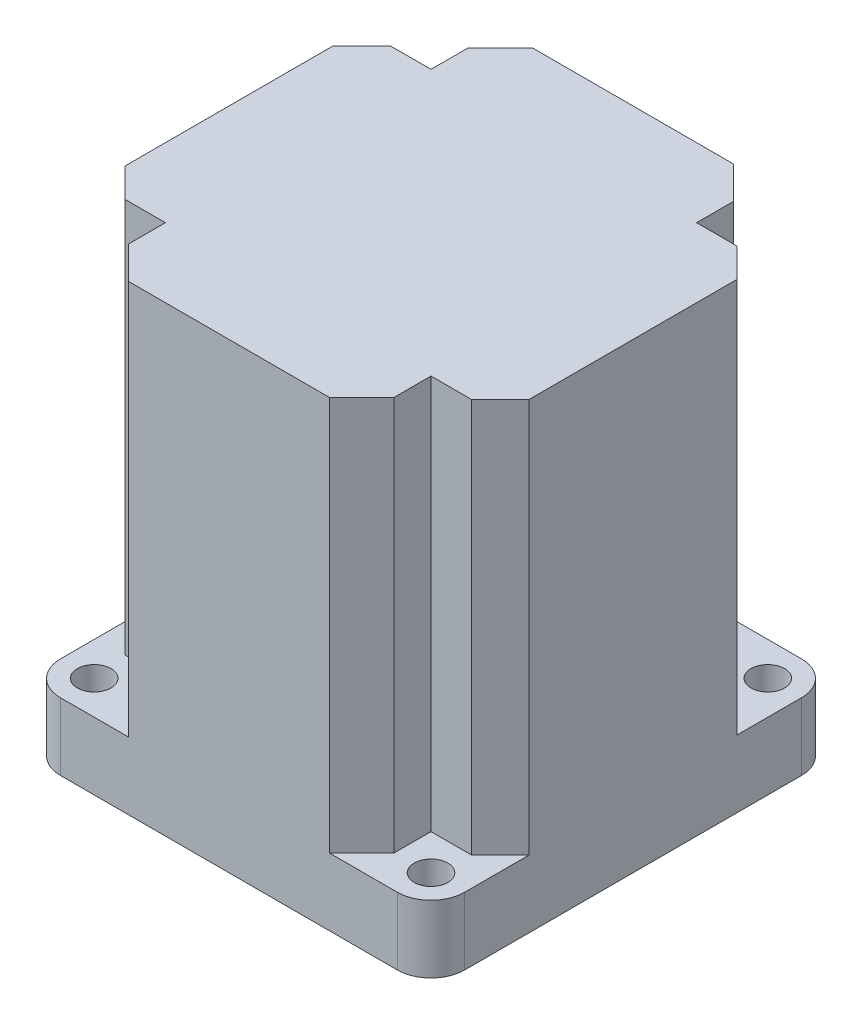
ISO-10303-21;
HEADER;
FILE_DESCRIPTION(('STEP AP214'),'2;1');
FILE_NAME('part.step','',(''),(''),'','','');
FILE_SCHEMA(('AUTOMOTIVE_DESIGN { 1 0 10303 214 1 1 1 1 }'));
ENDSEC;
DATA;
#1=APPLICATION_CONTEXT('core data for automotive mechanical design processes');
#2=APPLICATION_PROTOCOL_DEFINITION('international standard','automotive_design',2000,#1);
#3=PRODUCT_CONTEXT('',#1,'mechanical');
#4=PRODUCT('Part','Part','',(#3));
#5=PRODUCT_RELATED_PRODUCT_CATEGORY('part','',(#4));
#6=PRODUCT_DEFINITION_FORMATION('','',#4);
#7=PRODUCT_DEFINITION_CONTEXT('part definition',#1,'design');
#8=PRODUCT_DEFINITION('design','',#6,#7);
#9=PRODUCT_DEFINITION_SHAPE('','',#8);
#10=(LENGTH_UNIT() NAMED_UNIT(*) SI_UNIT(.MILLI.,.METRE.));
#11=(NAMED_UNIT(*) PLANE_ANGLE_UNIT() SI_UNIT($,.RADIAN.));
#12=(NAMED_UNIT(*) SI_UNIT($,.STERADIAN.) SOLID_ANGLE_UNIT());
#13=UNCERTAINTY_MEASURE_WITH_UNIT(LENGTH_MEASURE(1.E-05),#10,'distance_accuracy_value','');
#14=(GEOMETRIC_REPRESENTATION_CONTEXT(3) GLOBAL_UNCERTAINTY_ASSIGNED_CONTEXT((#13)) GLOBAL_UNIT_ASSIGNED_CONTEXT((#10,
#11,#12)) REPRESENTATION_CONTEXT('',''));
#15=CARTESIAN_POINT('',(0.,0.,0.));
#16=DIRECTION('',(0.,0.,1.));
#17=DIRECTION('',(1.,0.,0.));
#18=AXIS2_PLACEMENT_3D('',#15,#16,#17);
#19=CARTESIAN_POINT('',(17.5,7.,-17.5));
#20=DIRECTION('',(0.,-1.,0.));
#21=DIRECTION('',(0.,0.,-1.));
#22=AXIS2_PLACEMENT_3D('',#19,#20,#21);
#23=CYLINDRICAL_SURFACE('',#22,3.5);
#24=CARTESIAN_POINT('',(17.5,7.,-17.5));
#25=DIRECTION('',(0.,1.,0.));
#26=DIRECTION('',(0.,0.,1.));
#27=AXIS2_PLACEMENT_3D('',#24,#25,#26);
#28=CIRCLE('',#27,3.5);
#29=CARTESIAN_POINT('',(21.,7.,-17.5));
#30=VERTEX_POINT('',#29);
#31=CARTESIAN_POINT('',(17.5,7.,-21.));
#32=VERTEX_POINT('',#31);
#33=EDGE_CURVE('E437',#30,#32,#28,.T.);
#34=ORIENTED_EDGE('',*,*,#33,.F.);
#35=DIRECTION('',(0.,-1.,0.));
#36=VECTOR('',#35,1.);
#37=CARTESIAN_POINT('',(21.,7.,-17.5));
#38=LINE('',#37,#36);
#39=CARTESIAN_POINT('',(21.,0.,-17.5));
#40=VERTEX_POINT('',#39);
#41=EDGE_CURVE('E249',#30,#40,#38,.T.);
#42=ORIENTED_EDGE('',*,*,#41,.T.);
#43=CARTESIAN_POINT('',(17.5,0.,-17.5));
#44=DIRECTION('',(0.,1.,0.));
#45=DIRECTION('',(0.,0.,1.));
#46=AXIS2_PLACEMENT_3D('',#43,#44,#45);
#47=CIRCLE('',#46,3.5);
#48=CARTESIAN_POINT('',(17.5,0.,-21.));
#49=VERTEX_POINT('',#48);
#50=EDGE_CURVE('E283',#40,#49,#47,.T.);
#51=ORIENTED_EDGE('',*,*,#50,.T.);
#52=DIRECTION('',(0.,-1.,0.));
#53=VECTOR('',#52,1.);
#54=CARTESIAN_POINT('',(17.5,7.,-21.));
#55=LINE('',#54,#53);
#56=EDGE_CURVE('E11',#32,#49,#55,.T.);
#57=ORIENTED_EDGE('',*,*,#56,.F.);
#58=EDGE_LOOP('',(#34,#42,#51,#57));
#59=FACE_BOUND('',#58,.T.);
#60=ADVANCED_FACE('F38',(#59),#23,.T.);
#61=CARTESIAN_POINT('',(-17.5,7.,-17.5));
#62=DIRECTION('',(0.,-1.,0.));
#63=DIRECTION('',(0.,0.,-1.));
#64=AXIS2_PLACEMENT_3D('',#61,#62,#63);
#65=CYLINDRICAL_SURFACE('',#64,3.5);
#66=CARTESIAN_POINT('',(-17.5,7.,-17.5));
#67=DIRECTION('',(0.,1.,0.));
#68=DIRECTION('',(0.,0.,1.));
#69=AXIS2_PLACEMENT_3D('',#66,#67,#68);
#70=CIRCLE('',#69,3.5);
#71=CARTESIAN_POINT('',(-17.5,7.,-21.));
#72=VERTEX_POINT('',#71);
#73=CARTESIAN_POINT('',(-21.,7.,-17.5));
#74=VERTEX_POINT('',#73);
#75=EDGE_CURVE('E271',#72,#74,#70,.T.);
#76=ORIENTED_EDGE('',*,*,#75,.F.);
#77=DIRECTION('',(0.,-1.,0.));
#78=VECTOR('',#77,1.);
#79=CARTESIAN_POINT('',(-17.5,7.,-21.));
#80=LINE('',#79,#78);
#81=CARTESIAN_POINT('',(-17.5,0.,-21.));
#82=VERTEX_POINT('',#81);
#83=EDGE_CURVE('E45',#72,#82,#80,.T.);
#84=ORIENTED_EDGE('',*,*,#83,.T.);
#85=CARTESIAN_POINT('',(-17.5,0.,-17.5));
#86=DIRECTION('',(0.,1.,0.));
#87=DIRECTION('',(0.,0.,-1.));
#88=AXIS2_PLACEMENT_3D('',#85,#86,#87);
#89=CIRCLE('',#88,3.5);
#90=CARTESIAN_POINT('',(-21.,0.,-17.5));
#91=VERTEX_POINT('',#90);
#92=EDGE_CURVE('E269',#82,#91,#89,.T.);
#93=ORIENTED_EDGE('',*,*,#92,.T.);
#94=DIRECTION('',(0.,-1.,0.));
#95=VECTOR('',#94,1.);
#96=CARTESIAN_POINT('',(-21.,7.,-17.5));
#97=LINE('',#96,#95);
#98=EDGE_CURVE('E260',#74,#91,#97,.T.);
#99=ORIENTED_EDGE('',*,*,#98,.F.);
#100=EDGE_LOOP('',(#76,#84,#93,#99));
#101=FACE_BOUND('',#100,.T.);
#102=ADVANCED_FACE('F266',(#101),#65,.T.);
#103=CARTESIAN_POINT('',(-17.5,7.,17.5));
#104=DIRECTION('',(0.,-1.,0.));
#105=DIRECTION('',(0.,0.,-1.));
#106=AXIS2_PLACEMENT_3D('',#103,#104,#105);
#107=CYLINDRICAL_SURFACE('',#106,3.49999999999999);
#108=CARTESIAN_POINT('',(-17.5,7.,17.5));
#109=DIRECTION('',(0.,1.,0.));
#110=DIRECTION('',(0.,0.,1.));
#111=AXIS2_PLACEMENT_3D('',#108,#109,#110);
#112=CIRCLE('',#111,3.49999999999999);
#113=CARTESIAN_POINT('',(-21.,7.,17.5));
#114=VERTEX_POINT('',#113);
#115=CARTESIAN_POINT('',(-17.5,7.,21.));
#116=VERTEX_POINT('',#115);
#117=EDGE_CURVE('E396',#114,#116,#112,.T.);
#118=ORIENTED_EDGE('',*,*,#117,.F.);
#119=DIRECTION('',(0.,-1.,0.));
#120=VECTOR('',#119,1.);
#121=CARTESIAN_POINT('',(-21.,7.,17.5));
#122=LINE('',#121,#120);
#123=CARTESIAN_POINT('',(-21.,0.,17.5));
#124=VERTEX_POINT('',#123);
#125=EDGE_CURVE('E258',#114,#124,#122,.T.);
#126=ORIENTED_EDGE('',*,*,#125,.T.);
#127=CARTESIAN_POINT('',(-17.5,0.,17.5));
#128=DIRECTION('',(0.,1.,0.));
#129=DIRECTION('',(0.,0.,-1.));
#130=AXIS2_PLACEMENT_3D('',#127,#128,#129);
#131=CIRCLE('',#130,3.49999999999999);
#132=CARTESIAN_POINT('',(-17.5,0.,21.));
#133=VERTEX_POINT('',#132);
#134=EDGE_CURVE('E291',#124,#133,#131,.T.);
#135=ORIENTED_EDGE('',*,*,#134,.T.);
#136=DIRECTION('',(0.,-1.,0.));
#137=VECTOR('',#136,1.);
#138=CARTESIAN_POINT('',(-17.5,7.,21.));
#139=LINE('',#138,#137);
#140=EDGE_CURVE('E251',#116,#133,#139,.T.);
#141=ORIENTED_EDGE('',*,*,#140,.F.);
#142=EDGE_LOOP('',(#118,#126,#135,#141));
#143=FACE_BOUND('',#142,.T.);
#144=ADVANCED_FACE('F512',(#143),#107,.T.);
#145=CARTESIAN_POINT('',(17.5,7.,17.5));
#146=DIRECTION('',(0.,-1.,0.));
#147=DIRECTION('',(0.,0.,-1.));
#148=AXIS2_PLACEMENT_3D('',#145,#146,#147);
#149=CYLINDRICAL_SURFACE('',#148,3.5);
#150=CARTESIAN_POINT('',(17.5,7.,17.5));
#151=DIRECTION('',(0.,1.,0.));
#152=DIRECTION('',(0.,0.,1.));
#153=AXIS2_PLACEMENT_3D('',#150,#151,#152);
#154=CIRCLE('',#153,3.5);
#155=CARTESIAN_POINT('',(17.5,7.,21.));
#156=VERTEX_POINT('',#155);
#157=CARTESIAN_POINT('',(21.,7.,17.5));
#158=VERTEX_POINT('',#157);
#159=EDGE_CURVE('E222',#156,#158,#154,.T.);
#160=ORIENTED_EDGE('',*,*,#159,.F.);
#161=DIRECTION('',(0.,-1.,0.));
#162=VECTOR('',#161,1.);
#163=CARTESIAN_POINT('',(17.5,7.,21.));
#164=LINE('',#163,#162);
#165=CARTESIAN_POINT('',(17.5,0.,21.));
#166=VERTEX_POINT('',#165);
#167=EDGE_CURVE('E248',#156,#166,#164,.T.);
#168=ORIENTED_EDGE('',*,*,#167,.T.);
#169=CARTESIAN_POINT('',(17.5,0.,17.5));
#170=DIRECTION('',(0.,1.,0.));
#171=DIRECTION('',(0.,0.,-1.));
#172=AXIS2_PLACEMENT_3D('',#169,#170,#171);
#173=CIRCLE('',#172,3.5);
#174=CARTESIAN_POINT('',(21.,0.,17.5));
#175=VERTEX_POINT('',#174);
#176=EDGE_CURVE('E246',#166,#175,#173,.T.);
#177=ORIENTED_EDGE('',*,*,#176,.T.);
#178=DIRECTION('',(0.,-1.,0.));
#179=VECTOR('',#178,1.);
#180=CARTESIAN_POINT('',(21.,7.,17.5));
#181=LINE('',#180,#179);
#182=EDGE_CURVE('E239',#158,#175,#181,.T.);
#183=ORIENTED_EDGE('',*,*,#182,.F.);
#184=EDGE_LOOP('',(#160,#168,#177,#183));
#185=FACE_BOUND('',#184,.T.);
#186=ADVANCED_FACE('F244',(#185),#149,.T.);
#187=CARTESIAN_POINT('',(17.5,0.,-17.5));
#188=DIRECTION('',(0.,1.,0.));
#189=DIRECTION('',(0.,0.,1.));
#190=AXIS2_PLACEMENT_3D('',#187,#188,#189);
#191=PLANE('',#190);
#192=ORIENTED_EDGE('',*,*,#50,.F.);
#193=DIRECTION('',(0.,0.,-1.));
#194=VECTOR('',#193,1.);
#195=CARTESIAN_POINT('',(21.,0.,17.5));
#196=LINE('',#195,#194);
#197=EDGE_CURVE('E253',#175,#40,#196,.T.);
#198=ORIENTED_EDGE('',*,*,#197,.F.);
#199=ORIENTED_EDGE('',*,*,#176,.F.);
#200=DIRECTION('',(1.,0.,0.));
#201=VECTOR('',#200,1.);
#202=CARTESIAN_POINT('',(17.5,0.,21.));
#203=LINE('',#202,#201);
#204=EDGE_CURVE('E297',#133,#166,#203,.T.);
#205=ORIENTED_EDGE('',*,*,#204,.F.);
#206=ORIENTED_EDGE('',*,*,#134,.F.);
#207=DIRECTION('',(0.,0.,1.));
#208=VECTOR('',#207,1.);
#209=CARTESIAN_POINT('',(-21.,0.,17.5));
#210=LINE('',#209,#208);
#211=EDGE_CURVE('E289',#91,#124,#210,.T.);
#212=ORIENTED_EDGE('',*,*,#211,.F.);
#213=ORIENTED_EDGE('',*,*,#92,.F.);
#214=DIRECTION('',(-1.,0.,0.));
#215=VECTOR('',#214,1.);
#216=CARTESIAN_POINT('',(17.5,0.,-21.));
#217=LINE('',#216,#215);
#218=EDGE_CURVE('E275',#49,#82,#217,.T.);
#219=ORIENTED_EDGE('',*,*,#218,.F.);
#220=EDGE_LOOP('',(#192,#198,#199,#205,#206,#212,#213,#219));
#221=FACE_BOUND('',#220,.T.);
#222=CARTESIAN_POINT('',(-17.5,0.,17.5));
#223=DIRECTION('',(0.,1.,0.));
#224=DIRECTION('',(0.,0.,1.));
#225=AXIS2_PLACEMENT_3D('',#222,#223,#224);
#226=CIRCLE('',#225,1.75);
#227=CARTESIAN_POINT('',(-17.5,0.,19.25));
#228=VERTEX_POINT('',#227);
#229=EDGE_CURVE('E302',#228,#228,#226,.T.);
#230=ORIENTED_EDGE('',*,*,#229,.T.);
#231=EDGE_LOOP('',(#230));
#232=FACE_BOUND('',#231,.T.);
#233=CARTESIAN_POINT('',(-17.5,0.,-17.5));
#234=DIRECTION('',(0.,1.,0.));
#235=DIRECTION('',(0.,0.,-1.));
#236=AXIS2_PLACEMENT_3D('',#233,#234,#235);
#237=CIRCLE('',#236,1.75);
#238=CARTESIAN_POINT('',(-17.5,0.,-19.25));
#239=VERTEX_POINT('',#238);
#240=EDGE_CURVE('E304',#239,#239,#237,.T.);
#241=ORIENTED_EDGE('',*,*,#240,.T.);
#242=EDGE_LOOP('',(#241));
#243=FACE_BOUND('',#242,.T.);
#244=CARTESIAN_POINT('',(17.5,0.,17.5));
#245=DIRECTION('',(0.,1.,0.));
#246=DIRECTION('',(0.,0.,-1.));
#247=AXIS2_PLACEMENT_3D('',#244,#245,#246);
#248=CIRCLE('',#247,1.75000000000001);
#249=CARTESIAN_POINT('',(17.5,0.,15.75));
#250=VERTEX_POINT('',#249);
#251=EDGE_CURVE('E314',#250,#250,#248,.T.);
#252=ORIENTED_EDGE('',*,*,#251,.T.);
#253=EDGE_LOOP('',(#252));
#254=FACE_BOUND('',#253,.T.);
#255=CARTESIAN_POINT('',(17.5,0.,-17.5));
#256=DIRECTION('',(0.,1.,0.));
#257=DIRECTION('',(0.,0.,1.));
#258=AXIS2_PLACEMENT_3D('',#255,#256,#257);
#259=CIRCLE('',#258,1.75);
#260=CARTESIAN_POINT('',(17.5,0.,-15.75));
#261=VERTEX_POINT('',#260);
#262=EDGE_CURVE('E320',#261,#261,#259,.T.);
#263=ORIENTED_EDGE('',*,*,#262,.T.);
#264=EDGE_LOOP('',(#263));
#265=FACE_BOUND('',#264,.T.);
#266=CARTESIAN_POINT('',(0.,0.,0.));
#267=DIRECTION('',(0.,1.,0.));
#268=DIRECTION('',(0.,0.,1.));
#269=AXIS2_PLACEMENT_3D('',#266,#267,#268);
#270=CIRCLE('',#269,14.);
#271=CARTESIAN_POINT('',(0.,0.,14.));
#272=VERTEX_POINT('',#271);
#273=EDGE_CURVE('E327',#272,#272,#270,.T.);
#274=ORIENTED_EDGE('',*,*,#273,.T.);
#275=EDGE_LOOP('',(#274));
#276=FACE_BOUND('',#275,.T.);
#277=ADVANCED_FACE('F285',(#221,#232,#243,#254,#265,#276),#191,.F.);
#278=CARTESIAN_POINT('',(17.5,7.,-21.));
#279=DIRECTION('',(0.,0.,1.));
#280=DIRECTION('',(1.,0.,0.));
#281=AXIS2_PLACEMENT_3D('',#278,#279,#280);
#282=PLANE('',#281);
#283=DIRECTION('',(-1.,0.,0.));
#284=VECTOR('',#283,1.);
#285=CARTESIAN_POINT('',(17.5,48.,-21.));
#286=LINE('',#285,#284);
#287=CARTESIAN_POINT('',(10.4499999999999,48.,-21.));
#288=VERTEX_POINT('',#287);
#289=CARTESIAN_POINT('',(-10.45,48.,-21.));
#290=VERTEX_POINT('',#289);
#291=EDGE_CURVE('E317',#288,#290,#286,.T.);
#292=ORIENTED_EDGE('',*,*,#291,.F.);
#293=DIRECTION('',(0.,1.,0.));
#294=VECTOR('',#293,1.);
#295=CARTESIAN_POINT('',(10.4499999999999,7.,-21.));
#296=LINE('',#295,#294);
#297=CARTESIAN_POINT('',(10.4499999999999,7.,-21.));
#298=VERTEX_POINT('',#297);
#299=EDGE_CURVE('E424',#298,#288,#296,.T.);
#300=ORIENTED_EDGE('',*,*,#299,.F.);
#301=DIRECTION('',(-1.,0.,0.));
#302=VECTOR('',#301,1.);
#303=CARTESIAN_POINT('',(17.5,7.,-21.));
#304=LINE('',#303,#302);
#305=EDGE_CURVE('E459',#32,#298,#304,.T.);
#306=ORIENTED_EDGE('',*,*,#305,.F.);
#307=ORIENTED_EDGE('',*,*,#56,.T.);
#308=ORIENTED_EDGE('',*,*,#218,.T.);
#309=ORIENTED_EDGE('',*,*,#83,.F.);
#310=DIRECTION('',(-1.,0.,0.));
#311=VECTOR('',#310,1.);
#312=CARTESIAN_POINT('',(-10.45,7.,-21.));
#313=LINE('',#312,#311);
#314=CARTESIAN_POINT('',(-10.45,7.,-21.));
#315=VERTEX_POINT('',#314);
#316=EDGE_CURVE('E374',#315,#72,#313,.T.);
#317=ORIENTED_EDGE('',*,*,#316,.F.);
#318=DIRECTION('',(0.,1.,0.));
#319=VECTOR('',#318,1.);
#320=CARTESIAN_POINT('',(-10.45,7.,-21.));
#321=LINE('',#320,#319);
#322=EDGE_CURVE('E345',#315,#290,#321,.T.);
#323=ORIENTED_EDGE('',*,*,#322,.T.);
#324=EDGE_LOOP('',(#292,#300,#306,#307,#308,#309,#317,#323));
#325=FACE_BOUND('',#324,.T.);
#326=ADVANCED_FACE('F277',(#325),#282,.F.);
#327=CARTESIAN_POINT('',(-21.,7.,17.5));
#328=DIRECTION('',(1.,0.,0.));
#329=DIRECTION('',(0.,0.,-1.));
#330=AXIS2_PLACEMENT_3D('',#327,#328,#329);
#331=PLANE('',#330);
#332=DIRECTION('',(0.,0.,1.));
#333=VECTOR('',#332,1.);
#334=CARTESIAN_POINT('',(-21.,7.,10.8));
#335=LINE('',#334,#333);
#336=CARTESIAN_POINT('',(-21.,7.,10.8));
#337=VERTEX_POINT('',#336);
#338=EDGE_CURVE('E384',#337,#114,#335,.T.);
#339=ORIENTED_EDGE('',*,*,#338,.F.);
#340=DIRECTION('',(0.,1.,0.));
#341=VECTOR('',#340,1.);
#342=CARTESIAN_POINT('',(-21.,7.,10.8));
#343=LINE('',#342,#341);
#344=CARTESIAN_POINT('',(-21.,48.,10.8));
#345=VERTEX_POINT('',#344);
#346=EDGE_CURVE('E390',#337,#345,#343,.T.);
#347=ORIENTED_EDGE('',*,*,#346,.T.);
#348=DIRECTION('',(0.,0.,1.));
#349=VECTOR('',#348,1.);
#350=CARTESIAN_POINT('',(-21.,48.,-17.5));
#351=LINE('',#350,#349);
#352=CARTESIAN_POINT('',(-21.,48.,-10.8));
#353=VERTEX_POINT('',#352);
#354=EDGE_CURVE('E338',#353,#345,#351,.T.);
#355=ORIENTED_EDGE('',*,*,#354,.F.);
#356=DIRECTION('',(0.,1.,0.));
#357=VECTOR('',#356,1.);
#358=CARTESIAN_POINT('',(-21.,7.,-10.8));
#359=LINE('',#358,#357);
#360=CARTESIAN_POINT('',(-21.,7.,-10.8));
#361=VERTEX_POINT('',#360);
#362=EDGE_CURVE('E349',#361,#353,#359,.T.);
#363=ORIENTED_EDGE('',*,*,#362,.F.);
#364=DIRECTION('',(0.,0.,1.));
#365=VECTOR('',#364,1.);
#366=CARTESIAN_POINT('',(-21.,7.,-17.5));
#367=LINE('',#366,#365);
#368=EDGE_CURVE('E370',#74,#361,#367,.T.);
#369=ORIENTED_EDGE('',*,*,#368,.F.);
#370=ORIENTED_EDGE('',*,*,#98,.T.);
#371=ORIENTED_EDGE('',*,*,#211,.T.);
#372=ORIENTED_EDGE('',*,*,#125,.F.);
#373=EDGE_LOOP('',(#339,#347,#355,#363,#369,#370,#371,#372));
#374=FACE_BOUND('',#373,.T.);
#375=ADVANCED_FACE('F566',(#374),#331,.F.);
#376=CARTESIAN_POINT('',(17.5,7.,21.));
#377=DIRECTION('',(0.,0.,-1.));
#378=DIRECTION('',(-1.,0.,0.));
#379=AXIS2_PLACEMENT_3D('',#376,#377,#378);
#380=PLANE('',#379);
#381=DIRECTION('',(1.,0.,0.));
#382=VECTOR('',#381,1.);
#383=CARTESIAN_POINT('',(-17.5,48.,21.));
#384=LINE('',#383,#382);
#385=CARTESIAN_POINT('',(-10.4499999999999,48.,21.));
#386=VERTEX_POINT('',#385);
#387=CARTESIAN_POINT('',(10.4499999999999,48.,21.));
#388=VERTEX_POINT('',#387);
#389=EDGE_CURVE('E335',#386,#388,#384,.T.);
#390=ORIENTED_EDGE('',*,*,#389,.F.);
#391=DIRECTION('',(0.,1.,0.));
#392=VECTOR('',#391,1.);
#393=CARTESIAN_POINT('',(-10.4499999999999,7.,21.));
#394=LINE('',#393,#392);
#395=CARTESIAN_POINT('',(-10.4499999999999,7.,21.));
#396=VERTEX_POINT('',#395);
#397=EDGE_CURVE('E381',#396,#386,#394,.T.);
#398=ORIENTED_EDGE('',*,*,#397,.F.);
#399=DIRECTION('',(1.,0.,0.));
#400=VECTOR('',#399,1.);
#401=CARTESIAN_POINT('',(-17.5,7.,21.));
#402=LINE('',#401,#400);
#403=EDGE_CURVE('E420',#116,#396,#402,.T.);
#404=ORIENTED_EDGE('',*,*,#403,.F.);
#405=ORIENTED_EDGE('',*,*,#140,.T.);
#406=ORIENTED_EDGE('',*,*,#204,.T.);
#407=ORIENTED_EDGE('',*,*,#167,.F.);
#408=DIRECTION('',(1.,0.,0.));
#409=VECTOR('',#408,1.);
#410=CARTESIAN_POINT('',(10.4499999999999,7.,21.));
#411=LINE('',#410,#409);
#412=CARTESIAN_POINT('',(10.4499999999999,7.,21.));
#413=VERTEX_POINT('',#412);
#414=EDGE_CURVE('E229',#413,#156,#411,.T.);
#415=ORIENTED_EDGE('',*,*,#414,.F.);
#416=DIRECTION('',(0.,1.,0.));
#417=VECTOR('',#416,1.);
#418=CARTESIAN_POINT('',(10.4499999999999,7.,21.));
#419=LINE('',#418,#417);
#420=EDGE_CURVE('E406',#413,#388,#419,.T.);
#421=ORIENTED_EDGE('',*,*,#420,.T.);
#422=EDGE_LOOP('',(#390,#398,#404,#405,#406,#407,#415,#421));
#423=FACE_BOUND('',#422,.T.);
#424=ADVANCED_FACE('F549',(#423),#380,.F.);
#425=CARTESIAN_POINT('',(21.,7.,17.5));
#426=DIRECTION('',(-1.,0.,0.));
#427=DIRECTION('',(0.,0.,1.));
#428=AXIS2_PLACEMENT_3D('',#425,#426,#427);
#429=PLANE('',#428);
#430=DIRECTION('',(0.,0.,-1.));
#431=VECTOR('',#430,1.);
#432=CARTESIAN_POINT('',(21.,7.,-10.8));
#433=LINE('',#432,#431);
#434=CARTESIAN_POINT('',(21.,7.,-10.8));
#435=VERTEX_POINT('',#434);
#436=EDGE_CURVE('E427',#435,#30,#433,.T.);
#437=ORIENTED_EDGE('',*,*,#436,.F.);
#438=DIRECTION('',(0.,1.,0.));
#439=VECTOR('',#438,1.);
#440=CARTESIAN_POINT('',(21.,7.,-10.8));
#441=LINE('',#440,#439);
#442=CARTESIAN_POINT('',(21.,48.,-10.8));
#443=VERTEX_POINT('',#442);
#444=EDGE_CURVE('E364',#435,#443,#441,.T.);
#445=ORIENTED_EDGE('',*,*,#444,.T.);
#446=DIRECTION('',(0.,0.,-1.));
#447=VECTOR('',#446,1.);
#448=CARTESIAN_POINT('',(21.,48.,17.5));
#449=LINE('',#448,#447);
#450=CARTESIAN_POINT('',(21.,48.,10.8));
#451=VERTEX_POINT('',#450);
#452=EDGE_CURVE('E332',#451,#443,#449,.T.);
#453=ORIENTED_EDGE('',*,*,#452,.F.);
#454=DIRECTION('',(0.,1.,0.));
#455=VECTOR('',#454,1.);
#456=CARTESIAN_POINT('',(21.,7.,10.8));
#457=LINE('',#456,#455);
#458=CARTESIAN_POINT('',(21.,7.,10.8));
#459=VERTEX_POINT('',#458);
#460=EDGE_CURVE('E60',#459,#451,#457,.T.);
#461=ORIENTED_EDGE('',*,*,#460,.F.);
#462=DIRECTION('',(0.,0.,-1.));
#463=VECTOR('',#462,1.);
#464=CARTESIAN_POINT('',(21.,7.,17.5));
#465=LINE('',#464,#463);
#466=EDGE_CURVE('E226',#158,#459,#465,.T.);
#467=ORIENTED_EDGE('',*,*,#466,.F.);
#468=ORIENTED_EDGE('',*,*,#182,.T.);
#469=ORIENTED_EDGE('',*,*,#197,.T.);
#470=ORIENTED_EDGE('',*,*,#41,.F.);
#471=EDGE_LOOP('',(#437,#445,#453,#461,#467,#468,#469,#470));
#472=FACE_BOUND('',#471,.T.);
#473=ADVANCED_FACE('F237',(#472),#429,.F.);
#474=CARTESIAN_POINT('',(-17.5,7.,17.5));
#475=DIRECTION('',(0.,-1.,0.));
#476=DIRECTION('',(0.,0.,-1.));
#477=AXIS2_PLACEMENT_3D('',#474,#475,#476);
#478=CYLINDRICAL_SURFACE('',#477,1.75);
#479=CARTESIAN_POINT('',(-17.5,7.,17.5));
#480=DIRECTION('',(0.,1.,0.));
#481=DIRECTION('',(0.,0.,1.));
#482=AXIS2_PLACEMENT_3D('',#479,#480,#481);
#483=CIRCLE('',#482,1.75);
#484=CARTESIAN_POINT('',(-17.5,7.,19.25));
#485=VERTEX_POINT('',#484);
#486=EDGE_CURVE('E307',#485,#485,#483,.T.);
#487=ORIENTED_EDGE('',*,*,#486,.T.);
#488=EDGE_LOOP('',(#487));
#489=FACE_BOUND('',#488,.T.);
#490=ORIENTED_EDGE('',*,*,#229,.F.);
#491=EDGE_LOOP('',(#490));
#492=FACE_BOUND('',#491,.T.);
#493=ADVANCED_FACE('F612',(#489,#492),#478,.F.);
#494=CARTESIAN_POINT('',(-17.5,7.,-17.5));
#495=DIRECTION('',(0.,-1.,0.));
#496=DIRECTION('',(0.,0.,-1.));
#497=AXIS2_PLACEMENT_3D('',#494,#495,#496);
#498=CYLINDRICAL_SURFACE('',#497,1.75);
#499=CARTESIAN_POINT('',(-17.5,7.,-17.5));
#500=DIRECTION('',(0.,1.,0.));
#501=DIRECTION('',(0.,0.,-1.));
#502=AXIS2_PLACEMENT_3D('',#499,#500,#501);
#503=CIRCLE('',#502,1.75);
#504=CARTESIAN_POINT('',(-17.5,7.,-19.25));
#505=VERTEX_POINT('',#504);
#506=EDGE_CURVE('E310',#505,#505,#503,.T.);
#507=ORIENTED_EDGE('',*,*,#506,.T.);
#508=EDGE_LOOP('',(#507));
#509=FACE_BOUND('',#508,.T.);
#510=ORIENTED_EDGE('',*,*,#240,.F.);
#511=EDGE_LOOP('',(#510));
#512=FACE_BOUND('',#511,.T.);
#513=ADVANCED_FACE('F608',(#509,#512),#498,.F.);
#514=CARTESIAN_POINT('',(17.5,7.,17.5));
#515=DIRECTION('',(0.,-1.,0.));
#516=DIRECTION('',(0.,0.,-1.));
#517=AXIS2_PLACEMENT_3D('',#514,#515,#516);
#518=CYLINDRICAL_SURFACE('',#517,1.75000000000001);
#519=CARTESIAN_POINT('',(17.5,7.,17.5));
#520=DIRECTION('',(0.,1.,0.));
#521=DIRECTION('',(0.,0.,-1.));
#522=AXIS2_PLACEMENT_3D('',#519,#520,#521);
#523=CIRCLE('',#522,1.75000000000001);
#524=CARTESIAN_POINT('',(17.5,7.,15.75));
#525=VERTEX_POINT('',#524);
#526=EDGE_CURVE('E321',#525,#525,#523,.T.);
#527=ORIENTED_EDGE('',*,*,#526,.T.);
#528=EDGE_LOOP('',(#527));
#529=FACE_BOUND('',#528,.T.);
#530=ORIENTED_EDGE('',*,*,#251,.F.);
#531=EDGE_LOOP('',(#530));
#532=FACE_BOUND('',#531,.T.);
#533=ADVANCED_FACE('F604',(#529,#532),#518,.F.);
#534=CARTESIAN_POINT('',(17.5,7.,-17.5));
#535=DIRECTION('',(0.,-1.,0.));
#536=DIRECTION('',(0.,0.,-1.));
#537=AXIS2_PLACEMENT_3D('',#534,#535,#536);
#538=CYLINDRICAL_SURFACE('',#537,1.75);
#539=CARTESIAN_POINT('',(17.5,7.,-17.5));
#540=DIRECTION('',(0.,1.,0.));
#541=DIRECTION('',(0.,0.,1.));
#542=AXIS2_PLACEMENT_3D('',#539,#540,#541);
#543=CIRCLE('',#542,1.75);
#544=CARTESIAN_POINT('',(17.5,7.,-15.75));
#545=VERTEX_POINT('',#544);
#546=EDGE_CURVE('E311',#545,#545,#543,.T.);
#547=ORIENTED_EDGE('',*,*,#546,.T.);
#548=EDGE_LOOP('',(#547));
#549=FACE_BOUND('',#548,.T.);
#550=ORIENTED_EDGE('',*,*,#262,.F.);
#551=EDGE_LOOP('',(#550));
#552=FACE_BOUND('',#551,.T.);
#553=ADVANCED_FACE('F600',(#549,#552),#538,.F.);
#554=CARTESIAN_POINT('',(0.,7.,0.));
#555=DIRECTION('',(0.,-1.,0.));
#556=DIRECTION('',(0.,0.,-1.));
#557=AXIS2_PLACEMENT_3D('',#554,#555,#556);
#558=CYLINDRICAL_SURFACE('',#557,14.);
#559=ORIENTED_EDGE('',*,*,#273,.F.);
#560=EDGE_LOOP('',(#559));
#561=FACE_BOUND('',#560,.T.);
#562=CARTESIAN_POINT('',(0.,15.,0.));
#563=DIRECTION('',(0.,1.,0.));
#564=DIRECTION('',(0.,0.,1.));
#565=AXIS2_PLACEMENT_3D('',#562,#563,#564);
#566=CIRCLE('',#565,14.);
#567=CARTESIAN_POINT('',(0.,15.,14.));
#568=VERTEX_POINT('',#567);
#569=EDGE_CURVE('E481',#568,#568,#566,.T.);
#570=ORIENTED_EDGE('',*,*,#569,.T.);
#571=EDGE_LOOP('',(#570));
#572=FACE_BOUND('',#571,.T.);
#573=ADVANCED_FACE('F495',(#561,#572),#558,.F.);
#574=CARTESIAN_POINT('',(17.5,48.,-17.5));
#575=DIRECTION('',(0.,1.,0.));
#576=DIRECTION('',(0.,0.,1.));
#577=AXIS2_PLACEMENT_3D('',#574,#575,#576);
#578=PLANE('',#577);
#579=DIRECTION('',(0.707106781186549,0.,0.707106781186546));
#580=VECTOR('',#579,1.);
#581=CARTESIAN_POINT('',(18.,48.,-13.8));
#582=LINE('',#581,#580);
#583=CARTESIAN_POINT('',(18.,48.,-13.8));
#584=VERTEX_POINT('',#583);
#585=EDGE_CURVE('E435',#584,#443,#582,.T.);
#586=ORIENTED_EDGE('',*,*,#585,.F.);
#587=DIRECTION('',(1.,0.,0.));
#588=VECTOR('',#587,1.);
#589=CARTESIAN_POINT('',(13.8,48.,-13.8));
#590=LINE('',#589,#588);
#591=CARTESIAN_POINT('',(13.8,48.,-13.8));
#592=VERTEX_POINT('',#591);
#593=EDGE_CURVE('E438',#592,#584,#590,.T.);
#594=ORIENTED_EDGE('',*,*,#593,.F.);
#595=DIRECTION('',(0.,0.,1.));
#596=VECTOR('',#595,1.);
#597=CARTESIAN_POINT('',(13.8,48.,-13.8));
#598=LINE('',#597,#596);
#599=CARTESIAN_POINT('',(13.8,48.,-17.65));
#600=VERTEX_POINT('',#599);
#601=EDGE_CURVE('E441',#600,#592,#598,.T.);
#602=ORIENTED_EDGE('',*,*,#601,.F.);
#603=DIRECTION('',(0.707106781186552,0.,0.707106781186543));
#604=VECTOR('',#603,1.);
#605=CARTESIAN_POINT('',(13.8,48.,-17.65));
#606=LINE('',#605,#604);
#607=EDGE_CURVE('E393',#288,#600,#606,.T.);
#608=ORIENTED_EDGE('',*,*,#607,.F.);
#609=ORIENTED_EDGE('',*,*,#291,.T.);
#610=DIRECTION('',(0.70710678118655,0.,-0.707106781186545));
#611=VECTOR('',#610,1.);
#612=CARTESIAN_POINT('',(-13.8,48.,-17.65));
#613=LINE('',#612,#611);
#614=CARTESIAN_POINT('',(-13.8,48.,-17.65));
#615=VERTEX_POINT('',#614);
#616=EDGE_CURVE('E361',#615,#290,#613,.T.);
#617=ORIENTED_EDGE('',*,*,#616,.F.);
#618=DIRECTION('',(0.,0.,-1.));
#619=VECTOR('',#618,1.);
#620=CARTESIAN_POINT('',(-13.8,48.,-13.8));
#621=LINE('',#620,#619);
#622=CARTESIAN_POINT('',(-13.8,48.,-13.8));
#623=VERTEX_POINT('',#622);
#624=EDGE_CURVE('E52',#623,#615,#621,.T.);
#625=ORIENTED_EDGE('',*,*,#624,.F.);
#626=DIRECTION('',(1.,0.,0.));
#627=VECTOR('',#626,1.);
#628=CARTESIAN_POINT('',(-13.8,48.,-13.8));
#629=LINE('',#628,#627);
#630=CARTESIAN_POINT('',(-18.,48.,-13.8));
#631=VERTEX_POINT('',#630);
#632=EDGE_CURVE('E354',#631,#623,#629,.T.);
#633=ORIENTED_EDGE('',*,*,#632,.F.);
#634=DIRECTION('',(0.707106781186549,0.,-0.707106781186546));
#635=VECTOR('',#634,1.);
#636=CARTESIAN_POINT('',(-18.,48.,-13.8));
#637=LINE('',#636,#635);
#638=EDGE_CURVE('E358',#353,#631,#637,.T.);
#639=ORIENTED_EDGE('',*,*,#638,.F.);
#640=ORIENTED_EDGE('',*,*,#354,.T.);
#641=DIRECTION('',(-0.707106781186549,0.,-0.707106781186546));
#642=VECTOR('',#641,1.);
#643=CARTESIAN_POINT('',(-18.,48.,13.8));
#644=LINE('',#643,#642);
#645=CARTESIAN_POINT('',(-18.,48.,13.8));
#646=VERTEX_POINT('',#645);
#647=EDGE_CURVE('E394',#646,#345,#644,.T.);
#648=ORIENTED_EDGE('',*,*,#647,.F.);
#649=DIRECTION('',(-1.,0.,0.));
#650=VECTOR('',#649,1.);
#651=CARTESIAN_POINT('',(-13.8,48.,13.8));
#652=LINE('',#651,#650);
#653=CARTESIAN_POINT('',(-13.8,48.,13.8));
#654=VERTEX_POINT('',#653);
#655=EDGE_CURVE('E397',#654,#646,#652,.T.);
#656=ORIENTED_EDGE('',*,*,#655,.F.);
#657=DIRECTION('',(0.,0.,-1.));
#658=VECTOR('',#657,1.);
#659=CARTESIAN_POINT('',(-13.8,48.,13.8));
#660=LINE('',#659,#658);
#661=CARTESIAN_POINT('',(-13.8,48.,17.65));
#662=VERTEX_POINT('',#661);
#663=EDGE_CURVE('E400',#662,#654,#660,.T.);
#664=ORIENTED_EDGE('',*,*,#663,.F.);
#665=DIRECTION('',(-0.707106781186552,0.,-0.707106781186544));
#666=VECTOR('',#665,1.);
#667=CARTESIAN_POINT('',(-13.8,48.,17.65));
#668=LINE('',#667,#666);
#669=EDGE_CURVE('E403',#386,#662,#668,.T.);
#670=ORIENTED_EDGE('',*,*,#669,.F.);
#671=ORIENTED_EDGE('',*,*,#389,.T.);
#672=DIRECTION('',(-0.707106781186552,0.,0.707106781186544));
#673=VECTOR('',#672,1.);
#674=CARTESIAN_POINT('',(13.8,48.,17.65));
#675=LINE('',#674,#673);
#676=CARTESIAN_POINT('',(13.8,48.,17.65));
#677=VERTEX_POINT('',#676);
#678=EDGE_CURVE('E233',#677,#388,#675,.T.);
#679=ORIENTED_EDGE('',*,*,#678,.F.);
#680=DIRECTION('',(0.,0.,1.));
#681=VECTOR('',#680,1.);
#682=CARTESIAN_POINT('',(13.8,48.,13.8));
#683=LINE('',#682,#681);
#684=CARTESIAN_POINT('',(13.8,48.,13.8));
#685=VERTEX_POINT('',#684);
#686=EDGE_CURVE('E473',#685,#677,#683,.T.);
#687=ORIENTED_EDGE('',*,*,#686,.F.);
#688=DIRECTION('',(-1.,0.,0.));
#689=VECTOR('',#688,1.);
#690=CARTESIAN_POINT('',(13.8,48.,13.8));
#691=LINE('',#690,#689);
#692=CARTESIAN_POINT('',(18.,48.,13.8));
#693=VERTEX_POINT('',#692);
#694=EDGE_CURVE('E476',#693,#685,#691,.T.);
#695=ORIENTED_EDGE('',*,*,#694,.F.);
#696=DIRECTION('',(-0.707106781186549,0.,0.707106781186546));
#697=VECTOR('',#696,1.);
#698=CARTESIAN_POINT('',(18.,48.,13.8));
#699=LINE('',#698,#697);
#700=EDGE_CURVE('E479',#451,#693,#699,.T.);
#701=ORIENTED_EDGE('',*,*,#700,.F.);
#702=ORIENTED_EDGE('',*,*,#452,.T.);
#703=EDGE_LOOP('',(#586,#594,#602,#608,#609,#617,#625,#633,#639,#640,#648,#656,#664,#670,#671,
#679,#687,#695,#701,#702));
#704=FACE_BOUND('',#703,.T.);
#705=ADVANCED_FACE('F522',(#704),#578,.T.);
#706=CARTESIAN_POINT('',(-13.8,7.,-13.8));
#707=DIRECTION('',(1.,0.,0.));
#708=DIRECTION('',(0.,0.,-1.));
#709=AXIS2_PLACEMENT_3D('',#706,#707,#708);
#710=PLANE('',#709);
#711=ORIENTED_EDGE('',*,*,#624,.T.);
#712=DIRECTION('',(0.,1.,0.));
#713=VECTOR('',#712,1.);
#714=CARTESIAN_POINT('',(-13.8,7.,-17.65));
#715=LINE('',#714,#713);
#716=CARTESIAN_POINT('',(-13.8,7.,-17.65));
#717=VERTEX_POINT('',#716);
#718=EDGE_CURVE('E343',#717,#615,#715,.T.);
#719=ORIENTED_EDGE('',*,*,#718,.F.);
#720=DIRECTION('',(0.,0.,-1.));
#721=VECTOR('',#720,1.);
#722=CARTESIAN_POINT('',(-13.8,7.,-13.8));
#723=LINE('',#722,#721);
#724=CARTESIAN_POINT('',(-13.8,7.,-13.8));
#725=VERTEX_POINT('',#724);
#726=EDGE_CURVE('E357',#725,#717,#723,.T.);
#727=ORIENTED_EDGE('',*,*,#726,.F.);
#728=DIRECTION('',(0.,1.,0.));
#729=VECTOR('',#728,1.);
#730=CARTESIAN_POINT('',(-13.8,7.,-13.8));
#731=LINE('',#730,#729);
#732=EDGE_CURVE('E324',#725,#623,#731,.T.);
#733=ORIENTED_EDGE('',*,*,#732,.T.);
#734=EDGE_LOOP('',(#711,#719,#727,#733));
#735=FACE_BOUND('',#734,.T.);
#736=ADVANCED_FACE('F590',(#735),#710,.F.);
#737=CARTESIAN_POINT('',(-13.8,7.,-13.8));
#738=DIRECTION('',(0.,0.,1.));
#739=DIRECTION('',(1.,0.,0.));
#740=AXIS2_PLACEMENT_3D('',#737,#738,#739);
#741=PLANE('',#740);
#742=ORIENTED_EDGE('',*,*,#632,.T.);
#743=ORIENTED_EDGE('',*,*,#732,.F.);
#744=DIRECTION('',(1.,0.,0.));
#745=VECTOR('',#744,1.);
#746=CARTESIAN_POINT('',(-13.8,7.,-13.8));
#747=LINE('',#746,#745);
#748=CARTESIAN_POINT('',(-18.,7.,-13.8));
#749=VERTEX_POINT('',#748);
#750=EDGE_CURVE('E346',#749,#725,#747,.T.);
#751=ORIENTED_EDGE('',*,*,#750,.F.);
#752=DIRECTION('',(0.,1.,0.));
#753=VECTOR('',#752,1.);
#754=CARTESIAN_POINT('',(-18.,7.,-13.8));
#755=LINE('',#754,#753);
#756=EDGE_CURVE('E351',#749,#631,#755,.T.);
#757=ORIENTED_EDGE('',*,*,#756,.T.);
#758=EDGE_LOOP('',(#742,#743,#751,#757));
#759=FACE_BOUND('',#758,.T.);
#760=ADVANCED_FACE('F579',(#759),#741,.F.);
#761=CARTESIAN_POINT('',(-18.,7.,-13.8));
#762=DIRECTION('',(0.707106781186546,0.,0.707106781186549));
#763=DIRECTION('',(0.707106781186549,0.,-0.707106781186546));
#764=AXIS2_PLACEMENT_3D('',#761,#762,#763);
#765=PLANE('',#764);
#766=ORIENTED_EDGE('',*,*,#638,.T.);
#767=ORIENTED_EDGE('',*,*,#756,.F.);
#768=DIRECTION('',(0.707106781186549,0.,-0.707106781186546));
#769=VECTOR('',#768,1.);
#770=CARTESIAN_POINT('',(-18.,7.,-13.8));
#771=LINE('',#770,#769);
#772=EDGE_CURVE('E367',#361,#749,#771,.T.);
#773=ORIENTED_EDGE('',*,*,#772,.F.);
#774=ORIENTED_EDGE('',*,*,#362,.T.);
#775=EDGE_LOOP('',(#766,#767,#773,#774));
#776=FACE_BOUND('',#775,.T.);
#777=ADVANCED_FACE('F582',(#776),#765,.F.);
#778=CARTESIAN_POINT('',(-13.8,7.,-17.65));
#779=DIRECTION('',(0.707106781186545,0.,0.70710678118655));
#780=DIRECTION('',(0.70710678118655,0.,-0.707106781186545));
#781=AXIS2_PLACEMENT_3D('',#778,#779,#780);
#782=PLANE('',#781);
#783=ORIENTED_EDGE('',*,*,#616,.T.);
#784=ORIENTED_EDGE('',*,*,#322,.F.);
#785=DIRECTION('',(0.70710678118655,0.,-0.707106781186545));
#786=VECTOR('',#785,1.);
#787=CARTESIAN_POINT('',(-13.8,7.,-17.65));
#788=LINE('',#787,#786);
#789=EDGE_CURVE('E376',#717,#315,#788,.T.);
#790=ORIENTED_EDGE('',*,*,#789,.F.);
#791=ORIENTED_EDGE('',*,*,#718,.T.);
#792=EDGE_LOOP('',(#783,#784,#790,#791));
#793=FACE_BOUND('',#792,.T.);
#794=ADVANCED_FACE('F575',(#793),#782,.F.);
#795=CARTESIAN_POINT('',(-17.5,7.,-17.5));
#796=DIRECTION('',(0.,1.,0.));
#797=DIRECTION('',(0.,0.,1.));
#798=AXIS2_PLACEMENT_3D('',#795,#796,#797);
#799=PLANE('',#798);
#800=ORIENTED_EDGE('',*,*,#506,.F.);
#801=EDGE_LOOP('',(#800));
#802=FACE_BOUND('',#801,.T.);
#803=ORIENTED_EDGE('',*,*,#726,.T.);
#804=ORIENTED_EDGE('',*,*,#789,.T.);
#805=ORIENTED_EDGE('',*,*,#316,.T.);
#806=ORIENTED_EDGE('',*,*,#75,.T.);
#807=ORIENTED_EDGE('',*,*,#368,.T.);
#808=ORIENTED_EDGE('',*,*,#772,.T.);
#809=ORIENTED_EDGE('',*,*,#750,.T.);
#810=EDGE_LOOP('',(#803,#804,#805,#806,#807,#808,#809));
#811=FACE_BOUND('',#810,.T.);
#812=ADVANCED_FACE('F571',(#802,#811),#799,.T.);
#813=CARTESIAN_POINT('',(13.8,7.,17.65));
#814=DIRECTION('',(-0.707106781186543,0.,-0.707106781186551));
#815=DIRECTION('',(-0.707106781186552,0.,0.707106781186543));
#816=AXIS2_PLACEMENT_3D('',#813,#814,#815);
#817=PLANE('',#816);
#818=ORIENTED_EDGE('',*,*,#678,.T.);
#819=ORIENTED_EDGE('',*,*,#420,.F.);
#820=DIRECTION('',(-0.707106781186552,0.,0.707106781186544));
#821=VECTOR('',#820,1.);
#822=CARTESIAN_POINT('',(13.8,7.,17.65));
#823=LINE('',#822,#821);
#824=CARTESIAN_POINT('',(13.8,7.,17.65));
#825=VERTEX_POINT('',#824);
#826=EDGE_CURVE('E483',#825,#413,#823,.T.);
#827=ORIENTED_EDGE('',*,*,#826,.F.);
#828=DIRECTION('',(0.,1.,0.));
#829=VECTOR('',#828,1.);
#830=CARTESIAN_POINT('',(13.8,7.,17.65));
#831=LINE('',#830,#829);
#832=EDGE_CURVE('E468',#825,#677,#831,.T.);
#833=ORIENTED_EDGE('',*,*,#832,.T.);
#834=EDGE_LOOP('',(#818,#819,#827,#833));
#835=FACE_BOUND('',#834,.T.);
#836=ADVANCED_FACE('F546',(#835),#817,.F.);
#837=CARTESIAN_POINT('',(13.8,7.,13.8));
#838=DIRECTION('',(-1.,0.,0.));
#839=DIRECTION('',(0.,0.,1.));
#840=AXIS2_PLACEMENT_3D('',#837,#838,#839);
#841=PLANE('',#840);
#842=ORIENTED_EDGE('',*,*,#686,.T.);
#843=ORIENTED_EDGE('',*,*,#832,.F.);
#844=DIRECTION('',(0.,0.,1.));
#845=VECTOR('',#844,1.);
#846=CARTESIAN_POINT('',(13.8,7.,13.8));
#847=LINE('',#846,#845);
#848=CARTESIAN_POINT('',(13.8,7.,13.8));
#849=VERTEX_POINT('',#848);
#850=EDGE_CURVE('E485',#849,#825,#847,.T.);
#851=ORIENTED_EDGE('',*,*,#850,.F.);
#852=DIRECTION('',(0.,1.,0.));
#853=VECTOR('',#852,1.);
#854=CARTESIAN_POINT('',(13.8,7.,13.8));
#855=LINE('',#854,#853);
#856=EDGE_CURVE('E466',#849,#685,#855,.T.);
#857=ORIENTED_EDGE('',*,*,#856,.T.);
#858=EDGE_LOOP('',(#842,#843,#851,#857));
#859=FACE_BOUND('',#858,.T.);
#860=ADVANCED_FACE('F543',(#859),#841,.F.);
#861=CARTESIAN_POINT('',(13.8,7.,13.8));
#862=DIRECTION('',(0.,0.,-1.));
#863=DIRECTION('',(-1.,0.,0.));
#864=AXIS2_PLACEMENT_3D('',#861,#862,#863);
#865=PLANE('',#864);
#866=ORIENTED_EDGE('',*,*,#694,.T.);
#867=ORIENTED_EDGE('',*,*,#856,.F.);
#868=DIRECTION('',(-1.,0.,0.));
#869=VECTOR('',#868,1.);
#870=CARTESIAN_POINT('',(13.8,7.,13.8));
#871=LINE('',#870,#869);
#872=CARTESIAN_POINT('',(18.,7.,13.8));
#873=VERTEX_POINT('',#872);
#874=EDGE_CURVE('E488',#873,#849,#871,.T.);
#875=ORIENTED_EDGE('',*,*,#874,.F.);
#876=DIRECTION('',(0.,1.,0.));
#877=VECTOR('',#876,1.);
#878=CARTESIAN_POINT('',(18.,7.,13.8));
#879=LINE('',#878,#877);
#880=EDGE_CURVE('E464',#873,#693,#879,.T.);
#881=ORIENTED_EDGE('',*,*,#880,.T.);
#882=EDGE_LOOP('',(#866,#867,#875,#881));
#883=FACE_BOUND('',#882,.T.);
#884=ADVANCED_FACE('F539',(#883),#865,.F.);
#885=CARTESIAN_POINT('',(18.,7.,13.8));
#886=DIRECTION('',(-0.707106781186546,0.,-0.707106781186549));
#887=DIRECTION('',(-0.707106781186549,0.,0.707106781186546));
#888=AXIS2_PLACEMENT_3D('',#885,#886,#887);
#889=PLANE('',#888);
#890=ORIENTED_EDGE('',*,*,#700,.T.);
#891=ORIENTED_EDGE('',*,*,#880,.F.);
#892=DIRECTION('',(-0.707106781186549,0.,0.707106781186546));
#893=VECTOR('',#892,1.);
#894=CARTESIAN_POINT('',(18.,7.,13.8));
#895=LINE('',#894,#893);
#896=EDGE_CURVE('E242',#459,#873,#895,.T.);
#897=ORIENTED_EDGE('',*,*,#896,.F.);
#898=ORIENTED_EDGE('',*,*,#460,.T.);
#899=EDGE_LOOP('',(#890,#891,#897,#898));
#900=FACE_BOUND('',#899,.T.);
#901=ADVANCED_FACE('F536',(#900),#889,.F.);
#902=CARTESIAN_POINT('',(17.5,7.,17.5));
#903=DIRECTION('',(0.,1.,0.));
#904=DIRECTION('',(0.,0.,1.));
#905=AXIS2_PLACEMENT_3D('',#902,#903,#904);
#906=PLANE('',#905);
#907=ORIENTED_EDGE('',*,*,#526,.F.);
#908=EDGE_LOOP('',(#907));
#909=FACE_BOUND('',#908,.T.);
#910=ORIENTED_EDGE('',*,*,#159,.T.);
#911=ORIENTED_EDGE('',*,*,#466,.T.);
#912=ORIENTED_EDGE('',*,*,#896,.T.);
#913=ORIENTED_EDGE('',*,*,#874,.T.);
#914=ORIENTED_EDGE('',*,*,#850,.T.);
#915=ORIENTED_EDGE('',*,*,#826,.T.);
#916=ORIENTED_EDGE('',*,*,#414,.T.);
#917=EDGE_LOOP('',(#910,#911,#912,#913,#914,#915,#916));
#918=FACE_BOUND('',#917,.T.);
#919=ADVANCED_FACE('F224',(#909,#918),#906,.T.);
#920=CARTESIAN_POINT('',(-18.,7.,13.8));
#921=DIRECTION('',(0.707106781186546,0.,-0.707106781186549));
#922=DIRECTION('',(-0.707106781186549,0.,-0.707106781186546));
#923=AXIS2_PLACEMENT_3D('',#920,#921,#922);
#924=PLANE('',#923);
#925=ORIENTED_EDGE('',*,*,#647,.T.);
#926=ORIENTED_EDGE('',*,*,#346,.F.);
#927=DIRECTION('',(-0.707106781186549,0.,-0.707106781186546));
#928=VECTOR('',#927,1.);
#929=CARTESIAN_POINT('',(-18.,7.,13.8));
#930=LINE('',#929,#928);
#931=CARTESIAN_POINT('',(-18.,7.,13.8));
#932=VERTEX_POINT('',#931);
#933=EDGE_CURVE('E408',#932,#337,#930,.T.);
#934=ORIENTED_EDGE('',*,*,#933,.F.);
#935=DIRECTION('',(0.,1.,0.));
#936=VECTOR('',#935,1.);
#937=CARTESIAN_POINT('',(-18.,7.,13.8));
#938=LINE('',#937,#936);
#939=EDGE_CURVE('E388',#932,#646,#938,.T.);
#940=ORIENTED_EDGE('',*,*,#939,.T.);
#941=EDGE_LOOP('',(#925,#926,#934,#940));
#942=FACE_BOUND('',#941,.T.);
#943=ADVANCED_FACE('F738',(#942),#924,.F.);
#944=CARTESIAN_POINT('',(-13.8,7.,13.8));
#945=DIRECTION('',(0.,0.,-1.));
#946=DIRECTION('',(-1.,0.,0.));
#947=AXIS2_PLACEMENT_3D('',#944,#945,#946);
#948=PLANE('',#947);
#949=ORIENTED_EDGE('',*,*,#655,.T.);
#950=ORIENTED_EDGE('',*,*,#939,.F.);
#951=DIRECTION('',(-1.,0.,0.));
#952=VECTOR('',#951,1.);
#953=CARTESIAN_POINT('',(-13.8,7.,13.8));
#954=LINE('',#953,#952);
#955=CARTESIAN_POINT('',(-13.8,7.,13.8));
#956=VERTEX_POINT('',#955);
#957=EDGE_CURVE('E411',#956,#932,#954,.T.);
#958=ORIENTED_EDGE('',*,*,#957,.F.);
#959=DIRECTION('',(0.,1.,0.));
#960=VECTOR('',#959,1.);
#961=CARTESIAN_POINT('',(-13.8,7.,13.8));
#962=LINE('',#961,#960);
#963=EDGE_CURVE('E386',#956,#654,#962,.T.);
#964=ORIENTED_EDGE('',*,*,#963,.T.);
#965=EDGE_LOOP('',(#949,#950,#958,#964));
#966=FACE_BOUND('',#965,.T.);
#967=ADVANCED_FACE('F747',(#966),#948,.F.);
#968=CARTESIAN_POINT('',(-13.8,7.,13.8));
#969=DIRECTION('',(1.,0.,0.));
#970=DIRECTION('',(0.,0.,-1.));
#971=AXIS2_PLACEMENT_3D('',#968,#969,#970);
#972=PLANE('',#971);
#973=ORIENTED_EDGE('',*,*,#663,.T.);
#974=ORIENTED_EDGE('',*,*,#963,.F.);
#975=DIRECTION('',(0.,0.,-1.));
#976=VECTOR('',#975,1.);
#977=CARTESIAN_POINT('',(-13.8,7.,13.8));
#978=LINE('',#977,#976);
#979=CARTESIAN_POINT('',(-13.8,7.,17.65));
#980=VERTEX_POINT('',#979);
#981=EDGE_CURVE('E414',#980,#956,#978,.T.);
#982=ORIENTED_EDGE('',*,*,#981,.F.);
#983=DIRECTION('',(0.,1.,0.));
#984=VECTOR('',#983,1.);
#985=CARTESIAN_POINT('',(-13.8,7.,17.65));
#986=LINE('',#985,#984);
#987=EDGE_CURVE('E383',#980,#662,#986,.T.);
#988=ORIENTED_EDGE('',*,*,#987,.T.);
#989=EDGE_LOOP('',(#973,#974,#982,#988));
#990=FACE_BOUND('',#989,.T.);
#991=ADVANCED_FACE('F757',(#990),#972,.F.);
#992=CARTESIAN_POINT('',(-13.8,7.,17.65));
#993=DIRECTION('',(0.707106781186543,0.,-0.707106781186551));
#994=DIRECTION('',(-0.707106781186552,0.,-0.707106781186543));
#995=AXIS2_PLACEMENT_3D('',#992,#993,#994);
#996=PLANE('',#995);
#997=ORIENTED_EDGE('',*,*,#669,.T.);
#998=ORIENTED_EDGE('',*,*,#987,.F.);
#999=DIRECTION('',(-0.707106781186552,0.,-0.707106781186544));
#1000=VECTOR('',#999,1.);
#1001=CARTESIAN_POINT('',(-13.8,7.,17.65));
#1002=LINE('',#1001,#1000);
#1003=EDGE_CURVE('E417',#396,#980,#1002,.T.);
#1004=ORIENTED_EDGE('',*,*,#1003,.F.);
#1005=ORIENTED_EDGE('',*,*,#397,.T.);
#1006=EDGE_LOOP('',(#997,#998,#1004,#1005));
#1007=FACE_BOUND('',#1006,.T.);
#1008=ADVANCED_FACE('F555',(#1007),#996,.F.);
#1009=CARTESIAN_POINT('',(-17.5,7.,17.5));
#1010=DIRECTION('',(0.,1.,0.));
#1011=DIRECTION('',(0.,0.,1.));
#1012=AXIS2_PLACEMENT_3D('',#1009,#1010,#1011);
#1013=PLANE('',#1012);
#1014=ORIENTED_EDGE('',*,*,#486,.F.);
#1015=EDGE_LOOP('',(#1014));
#1016=FACE_BOUND('',#1015,.T.);
#1017=ORIENTED_EDGE('',*,*,#117,.T.);
#1018=ORIENTED_EDGE('',*,*,#403,.T.);
#1019=ORIENTED_EDGE('',*,*,#1003,.T.);
#1020=ORIENTED_EDGE('',*,*,#981,.T.);
#1021=ORIENTED_EDGE('',*,*,#957,.T.);
#1022=ORIENTED_EDGE('',*,*,#933,.T.);
#1023=ORIENTED_EDGE('',*,*,#338,.T.);
#1024=EDGE_LOOP('',(#1017,#1018,#1019,#1020,#1021,#1022,#1023));
#1025=FACE_BOUND('',#1024,.T.);
#1026=ADVANCED_FACE('F776',(#1016,#1025),#1013,.T.);
#1027=CARTESIAN_POINT('',(18.,7.,-13.8));
#1028=DIRECTION('',(-0.707106781186546,0.,0.707106781186549));
#1029=DIRECTION('',(0.707106781186549,0.,0.707106781186546));
#1030=AXIS2_PLACEMENT_3D('',#1027,#1028,#1029);
#1031=PLANE('',#1030);
#1032=ORIENTED_EDGE('',*,*,#585,.T.);
#1033=ORIENTED_EDGE('',*,*,#444,.F.);
#1034=DIRECTION('',(0.707106781186549,0.,0.707106781186546));
#1035=VECTOR('',#1034,1.);
#1036=CARTESIAN_POINT('',(18.,7.,-13.8));
#1037=LINE('',#1036,#1035);
#1038=CARTESIAN_POINT('',(18.,7.,-13.8));
#1039=VERTEX_POINT('',#1038);
#1040=EDGE_CURVE('E447',#1039,#435,#1037,.T.);
#1041=ORIENTED_EDGE('',*,*,#1040,.F.);
#1042=DIRECTION('',(0.,1.,0.));
#1043=VECTOR('',#1042,1.);
#1044=CARTESIAN_POINT('',(18.,7.,-13.8));
#1045=LINE('',#1044,#1043);
#1046=EDGE_CURVE('E431',#1039,#584,#1045,.T.);
#1047=ORIENTED_EDGE('',*,*,#1046,.T.);
#1048=EDGE_LOOP('',(#1032,#1033,#1041,#1047));
#1049=FACE_BOUND('',#1048,.T.);
#1050=ADVANCED_FACE('F533',(#1049),#1031,.F.);
#1051=CARTESIAN_POINT('',(13.8,7.,-13.8));
#1052=DIRECTION('',(0.,0.,1.));
#1053=DIRECTION('',(1.,0.,0.));
#1054=AXIS2_PLACEMENT_3D('',#1051,#1052,#1053);
#1055=PLANE('',#1054);
#1056=ORIENTED_EDGE('',*,*,#593,.T.);
#1057=ORIENTED_EDGE('',*,*,#1046,.F.);
#1058=DIRECTION('',(1.,0.,0.));
#1059=VECTOR('',#1058,1.);
#1060=CARTESIAN_POINT('',(13.8,7.,-13.8));
#1061=LINE('',#1060,#1059);
#1062=CARTESIAN_POINT('',(13.8,7.,-13.8));
#1063=VERTEX_POINT('',#1062);
#1064=EDGE_CURVE('E450',#1063,#1039,#1061,.T.);
#1065=ORIENTED_EDGE('',*,*,#1064,.F.);
#1066=DIRECTION('',(0.,1.,0.));
#1067=VECTOR('',#1066,1.);
#1068=CARTESIAN_POINT('',(13.8,7.,-13.8));
#1069=LINE('',#1068,#1067);
#1070=EDGE_CURVE('E429',#1063,#592,#1069,.T.);
#1071=ORIENTED_EDGE('',*,*,#1070,.T.);
#1072=EDGE_LOOP('',(#1056,#1057,#1065,#1071));
#1073=FACE_BOUND('',#1072,.T.);
#1074=ADVANCED_FACE('F531',(#1073),#1055,.F.);
#1075=CARTESIAN_POINT('',(13.8,7.,-13.8));
#1076=DIRECTION('',(-1.,0.,0.));
#1077=DIRECTION('',(0.,0.,1.));
#1078=AXIS2_PLACEMENT_3D('',#1075,#1076,#1077);
#1079=PLANE('',#1078);
#1080=ORIENTED_EDGE('',*,*,#601,.T.);
#1081=ORIENTED_EDGE('',*,*,#1070,.F.);
#1082=DIRECTION('',(0.,0.,1.));
#1083=VECTOR('',#1082,1.);
#1084=CARTESIAN_POINT('',(13.8,7.,-13.8));
#1085=LINE('',#1084,#1083);
#1086=CARTESIAN_POINT('',(13.8,7.,-17.65));
#1087=VERTEX_POINT('',#1086);
#1088=EDGE_CURVE('E453',#1087,#1063,#1085,.T.);
#1089=ORIENTED_EDGE('',*,*,#1088,.F.);
#1090=DIRECTION('',(0.,1.,0.));
#1091=VECTOR('',#1090,1.);
#1092=CARTESIAN_POINT('',(13.8,7.,-17.65));
#1093=LINE('',#1092,#1091);
#1094=EDGE_CURVE('E426',#1087,#600,#1093,.T.);
#1095=ORIENTED_EDGE('',*,*,#1094,.T.);
#1096=EDGE_LOOP('',(#1080,#1081,#1089,#1095));
#1097=FACE_BOUND('',#1096,.T.);
#1098=ADVANCED_FACE('F526',(#1097),#1079,.F.);
#1099=CARTESIAN_POINT('',(13.8,7.,-17.65));
#1100=DIRECTION('',(-0.707106781186543,0.,0.707106781186552));
#1101=DIRECTION('',(0.707106781186552,0.,0.707106781186543));
#1102=AXIS2_PLACEMENT_3D('',#1099,#1100,#1101);
#1103=PLANE('',#1102);
#1104=ORIENTED_EDGE('',*,*,#607,.T.);
#1105=ORIENTED_EDGE('',*,*,#1094,.F.);
#1106=DIRECTION('',(0.707106781186552,0.,0.707106781186543));
#1107=VECTOR('',#1106,1.);
#1108=CARTESIAN_POINT('',(13.8,7.,-17.65));
#1109=LINE('',#1108,#1107);
#1110=EDGE_CURVE('E456',#298,#1087,#1109,.T.);
#1111=ORIENTED_EDGE('',*,*,#1110,.F.);
#1112=ORIENTED_EDGE('',*,*,#299,.T.);
#1113=EDGE_LOOP('',(#1104,#1105,#1111,#1112));
#1114=FACE_BOUND('',#1113,.T.);
#1115=ADVANCED_FACE('F504',(#1114),#1103,.F.);
#1116=CARTESIAN_POINT('',(17.5,7.,-17.5));
#1117=DIRECTION('',(0.,1.,0.));
#1118=DIRECTION('',(0.,0.,1.));
#1119=AXIS2_PLACEMENT_3D('',#1116,#1117,#1118);
#1120=PLANE('',#1119);
#1121=ORIENTED_EDGE('',*,*,#546,.F.);
#1122=EDGE_LOOP('',(#1121));
#1123=FACE_BOUND('',#1122,.T.);
#1124=ORIENTED_EDGE('',*,*,#33,.T.);
#1125=ORIENTED_EDGE('',*,*,#305,.T.);
#1126=ORIENTED_EDGE('',*,*,#1110,.T.);
#1127=ORIENTED_EDGE('',*,*,#1088,.T.);
#1128=ORIENTED_EDGE('',*,*,#1064,.T.);
#1129=ORIENTED_EDGE('',*,*,#1040,.T.);
#1130=ORIENTED_EDGE('',*,*,#436,.T.);
#1131=EDGE_LOOP('',(#1124,#1125,#1126,#1127,#1128,#1129,#1130));
#1132=FACE_BOUND('',#1131,.T.);
#1133=ADVANCED_FACE('F499',(#1123,#1132),#1120,.T.);
#1134=CARTESIAN_POINT('',(0.,15.,0.));
#1135=DIRECTION('',(0.,1.,0.));
#1136=DIRECTION('',(0.,0.,1.));
#1137=AXIS2_PLACEMENT_3D('',#1134,#1135,#1136);
#1138=PLANE('',#1137);
#1139=ORIENTED_EDGE('',*,*,#569,.F.);
#1140=EDGE_LOOP('',(#1139));
#1141=FACE_BOUND('',#1140,.T.);
#1142=ADVANCED_FACE('F497',(#1141),#1138,.F.);
#1143=CLOSED_SHELL('',(#60,#102,#144,#186,#277,#326,#375,#424,#473,#493,#513,#533,#553,#573,
#705,#736,#760,#777,#794,#812,#836,#860,#884,#901,#919,#943,#967,#991,#1008,#1026,#1050,#1074,
#1098,#1115,#1133,#1142));
#1144=MANIFOLD_SOLID_BREP('B2',#1143);
#1145=ADVANCED_BREP_SHAPE_REPRESENTATION('',(#18,#1144),#14);
#1146=SHAPE_DEFINITION_REPRESENTATION(#9,#1145);
ENDSEC;
END-ISO-10303-21;
